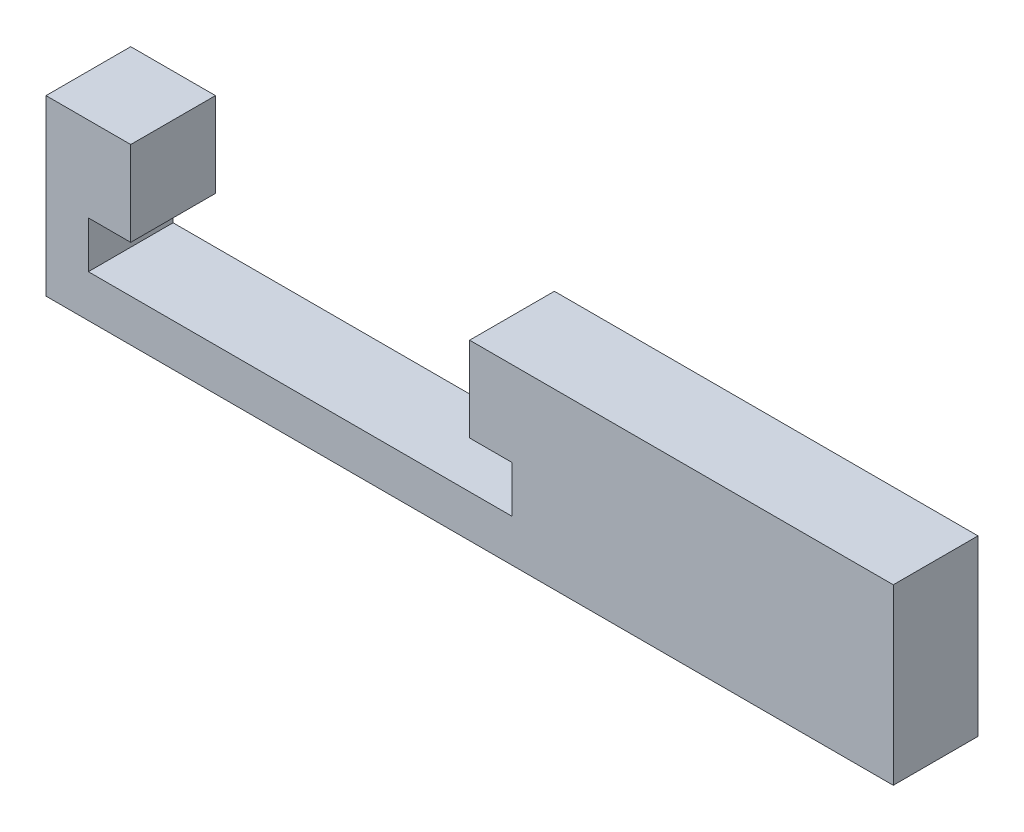
ISO-10303-21;
HEADER;
FILE_DESCRIPTION(('STEP AP214'),'2;1');
FILE_NAME('part.step','',(''),(''),'','','');
FILE_SCHEMA(('AUTOMOTIVE_DESIGN { 1 0 10303 214 1 1 1 1 }'));
ENDSEC;
DATA;
#1=APPLICATION_CONTEXT('core data for automotive mechanical design processes');
#2=APPLICATION_PROTOCOL_DEFINITION('international standard','automotive_design',2000,#1);
#3=PRODUCT_CONTEXT('',#1,'mechanical');
#4=PRODUCT('Part','Part','',(#3));
#5=PRODUCT_RELATED_PRODUCT_CATEGORY('part','',(#4));
#6=PRODUCT_DEFINITION_FORMATION('','',#4);
#7=PRODUCT_DEFINITION_CONTEXT('part definition',#1,'design');
#8=PRODUCT_DEFINITION('design','',#6,#7);
#9=PRODUCT_DEFINITION_SHAPE('','',#8);
#10=(LENGTH_UNIT() NAMED_UNIT(*) SI_UNIT(.MILLI.,.METRE.));
#11=(NAMED_UNIT(*) PLANE_ANGLE_UNIT() SI_UNIT($,.RADIAN.));
#12=(NAMED_UNIT(*) SI_UNIT($,.STERADIAN.) SOLID_ANGLE_UNIT());
#13=UNCERTAINTY_MEASURE_WITH_UNIT(LENGTH_MEASURE(1.E-05),#10,'distance_accuracy_value','');
#14=(GEOMETRIC_REPRESENTATION_CONTEXT(3) GLOBAL_UNCERTAINTY_ASSIGNED_CONTEXT((#13)) GLOBAL_UNIT_ASSIGNED_CONTEXT((#10,
#11,#12)) REPRESENTATION_CONTEXT('',''));
#15=CARTESIAN_POINT('',(0.,0.,0.));
#16=DIRECTION('',(0.,0.,1.));
#17=DIRECTION('',(1.,0.,0.));
#18=AXIS2_PLACEMENT_3D('',#15,#16,#17);
#19=CARTESIAN_POINT('',(-12.7,0.,5.08));
#20=DIRECTION('',(0.,1.,0.));
#21=DIRECTION('',(0.,0.,1.));
#22=AXIS2_PLACEMENT_3D('',#19,#20,#21);
#23=PLANE('',#22);
#24=DIRECTION('',(1.,0.,0.));
#25=VECTOR('',#24,1.);
#26=CARTESIAN_POINT('',(-12.7,0.,0.));
#27=LINE('',#26,#25);
#28=CARTESIAN_POINT('',(-12.7,0.,0.));
#29=VERTEX_POINT('',#28);
#30=CARTESIAN_POINT('',(12.7,0.,0.));
#31=VERTEX_POINT('',#30);
#32=EDGE_CURVE('E155',#29,#31,#27,.T.);
#33=ORIENTED_EDGE('',*,*,#32,.F.);
#34=DIRECTION('',(0.,0.,-1.));
#35=VECTOR('',#34,1.);
#36=CARTESIAN_POINT('',(-12.7,0.,5.08));
#37=LINE('',#36,#35);
#38=CARTESIAN_POINT('',(-12.7,0.,5.08));
#39=VERTEX_POINT('',#38);
#40=EDGE_CURVE('E11',#39,#29,#37,.T.);
#41=ORIENTED_EDGE('',*,*,#40,.F.);
#42=DIRECTION('',(1.,0.,0.));
#43=VECTOR('',#42,1.);
#44=CARTESIAN_POINT('',(-12.7,0.,5.08));
#45=LINE('',#44,#43);
#46=CARTESIAN_POINT('',(12.7,0.,5.08));
#47=VERTEX_POINT('',#46);
#48=EDGE_CURVE('E182',#39,#47,#45,.T.);
#49=ORIENTED_EDGE('',*,*,#48,.T.);
#50=DIRECTION('',(0.,0.,-1.));
#51=VECTOR('',#50,1.);
#52=CARTESIAN_POINT('',(12.7,0.,5.08));
#53=LINE('',#52,#51);
#54=EDGE_CURVE('E36',#47,#31,#53,.T.);
#55=ORIENTED_EDGE('',*,*,#54,.T.);
#56=EDGE_LOOP('',(#33,#41,#49,#55));
#57=FACE_BOUND('',#56,.T.);
#58=ADVANCED_FACE('F33',(#57),#23,.T.);
#59=CARTESIAN_POINT('',(-12.7,0.,5.08));
#60=DIRECTION('',(-1.,0.,0.));
#61=DIRECTION('',(0.,0.,1.));
#62=AXIS2_PLACEMENT_3D('',#59,#60,#61);
#63=PLANE('',#62);
#64=DIRECTION('',(0.,1.,0.));
#65=VECTOR('',#64,1.);
#66=CARTESIAN_POINT('',(-12.7,0.,0.));
#67=LINE('',#66,#65);
#68=CARTESIAN_POINT('',(-12.7,2.794,0.));
#69=VERTEX_POINT('',#68);
#70=EDGE_CURVE('E90',#29,#69,#67,.T.);
#71=ORIENTED_EDGE('',*,*,#70,.T.);
#72=DIRECTION('',(0.,0.,-1.));
#73=VECTOR('',#72,1.);
#74=CARTESIAN_POINT('',(-12.7,2.794,5.08));
#75=LINE('',#74,#73);
#76=CARTESIAN_POINT('',(-12.7,2.794,5.08));
#77=VERTEX_POINT('',#76);
#78=EDGE_CURVE('E42',#77,#69,#75,.T.);
#79=ORIENTED_EDGE('',*,*,#78,.F.);
#80=DIRECTION('',(0.,1.,0.));
#81=VECTOR('',#80,1.);
#82=CARTESIAN_POINT('',(-12.7,0.,5.08));
#83=LINE('',#82,#81);
#84=EDGE_CURVE('E133',#39,#77,#83,.T.);
#85=ORIENTED_EDGE('',*,*,#84,.F.);
#86=ORIENTED_EDGE('',*,*,#40,.T.);
#87=EDGE_LOOP('',(#71,#79,#85,#86));
#88=FACE_BOUND('',#87,.T.);
#89=ADVANCED_FACE('F260',(#88),#63,.F.);
#90=CARTESIAN_POINT('',(-12.7,2.794,5.08));
#91=DIRECTION('',(0.,1.,0.));
#92=DIRECTION('',(0.,0.,1.));
#93=AXIS2_PLACEMENT_3D('',#90,#91,#92);
#94=PLANE('',#93);
#95=DIRECTION('',(1.,0.,0.));
#96=VECTOR('',#95,1.);
#97=CARTESIAN_POINT('',(-12.7,2.794,0.));
#98=LINE('',#97,#96);
#99=CARTESIAN_POINT('',(-10.16,2.794,0.));
#100=VERTEX_POINT('',#99);
#101=EDGE_CURVE('E140',#69,#100,#98,.T.);
#102=ORIENTED_EDGE('',*,*,#101,.T.);
#103=DIRECTION('',(0.,0.,-1.));
#104=VECTOR('',#103,1.);
#105=CARTESIAN_POINT('',(-10.16,2.794,5.08));
#106=LINE('',#105,#104);
#107=CARTESIAN_POINT('',(-10.16,2.794,5.08));
#108=VERTEX_POINT('',#107);
#109=EDGE_CURVE('E137',#108,#100,#106,.T.);
#110=ORIENTED_EDGE('',*,*,#109,.F.);
#111=DIRECTION('',(1.,0.,0.));
#112=VECTOR('',#111,1.);
#113=CARTESIAN_POINT('',(-12.7,2.794,5.08));
#114=LINE('',#113,#112);
#115=EDGE_CURVE('E126',#77,#108,#114,.T.);
#116=ORIENTED_EDGE('',*,*,#115,.F.);
#117=ORIENTED_EDGE('',*,*,#78,.T.);
#118=EDGE_LOOP('',(#102,#110,#116,#117));
#119=FACE_BOUND('',#118,.T.);
#120=ADVANCED_FACE('F138',(#119),#94,.F.);
#121=CARTESIAN_POINT('',(-10.16,2.794,5.08));
#122=DIRECTION('',(-1.,0.,0.));
#123=DIRECTION('',(0.,0.,1.));
#124=AXIS2_PLACEMENT_3D('',#121,#122,#123);
#125=PLANE('',#124);
#126=DIRECTION('',(0.,1.,0.));
#127=VECTOR('',#126,1.);
#128=CARTESIAN_POINT('',(-10.16,2.794,0.));
#129=LINE('',#128,#127);
#130=CARTESIAN_POINT('',(-10.16,7.874,0.));
#131=VERTEX_POINT('',#130);
#132=EDGE_CURVE('E179',#100,#131,#129,.T.);
#133=ORIENTED_EDGE('',*,*,#132,.T.);
#134=DIRECTION('',(0.,0.,-1.));
#135=VECTOR('',#134,1.);
#136=CARTESIAN_POINT('',(-10.16,7.874,5.08));
#137=LINE('',#136,#135);
#138=CARTESIAN_POINT('',(-10.16,7.874,5.08));
#139=VERTEX_POINT('',#138);
#140=EDGE_CURVE('E143',#139,#131,#137,.T.);
#141=ORIENTED_EDGE('',*,*,#140,.F.);
#142=DIRECTION('',(0.,1.,0.));
#143=VECTOR('',#142,1.);
#144=CARTESIAN_POINT('',(-10.16,2.794,5.08));
#145=LINE('',#144,#143);
#146=EDGE_CURVE('E131',#108,#139,#145,.T.);
#147=ORIENTED_EDGE('',*,*,#146,.F.);
#148=ORIENTED_EDGE('',*,*,#109,.T.);
#149=EDGE_LOOP('',(#133,#141,#147,#148));
#150=FACE_BOUND('',#149,.T.);
#151=ADVANCED_FACE('F145',(#150),#125,.F.);
#152=CARTESIAN_POINT('',(-10.16,7.874,5.08));
#153=DIRECTION('',(0.,-1.,0.));
#154=DIRECTION('',(1.,0.,0.));
#155=AXIS2_PLACEMENT_3D('',#152,#153,#154);
#156=PLANE('',#155);
#157=DIRECTION('',(-1.,0.,0.));
#158=VECTOR('',#157,1.);
#159=CARTESIAN_POINT('',(-10.16,7.874,0.));
#160=LINE('',#159,#158);
#161=CARTESIAN_POINT('',(-15.24,7.874,0.));
#162=VERTEX_POINT('',#161);
#163=EDGE_CURVE('E177',#131,#162,#160,.T.);
#164=ORIENTED_EDGE('',*,*,#163,.T.);
#165=DIRECTION('',(0.,0.,-1.));
#166=VECTOR('',#165,1.);
#167=CARTESIAN_POINT('',(-15.24,7.874,5.08));
#168=LINE('',#167,#166);
#169=CARTESIAN_POINT('',(-15.24,7.874,5.08));
#170=VERTEX_POINT('',#169);
#171=EDGE_CURVE('E186',#170,#162,#168,.T.);
#172=ORIENTED_EDGE('',*,*,#171,.F.);
#173=DIRECTION('',(-1.,0.,0.));
#174=VECTOR('',#173,1.);
#175=CARTESIAN_POINT('',(-10.16,7.874,5.08));
#176=LINE('',#175,#174);
#177=EDGE_CURVE('E148',#139,#170,#176,.T.);
#178=ORIENTED_EDGE('',*,*,#177,.F.);
#179=ORIENTED_EDGE('',*,*,#140,.T.);
#180=EDGE_LOOP('',(#164,#172,#178,#179));
#181=FACE_BOUND('',#180,.T.);
#182=ADVANCED_FACE('F209',(#181),#156,.F.);
#183=CARTESIAN_POINT('',(-15.24,7.874,5.08));
#184=DIRECTION('',(1.,0.,0.));
#185=DIRECTION('',(0.,1.,0.));
#186=AXIS2_PLACEMENT_3D('',#183,#184,#185);
#187=PLANE('',#186);
#188=DIRECTION('',(0.,-1.,0.));
#189=VECTOR('',#188,1.);
#190=CARTESIAN_POINT('',(-15.24,7.874,0.));
#191=LINE('',#190,#189);
#192=CARTESIAN_POINT('',(-15.24,-2.54,0.));
#193=VERTEX_POINT('',#192);
#194=EDGE_CURVE('E175',#162,#193,#191,.T.);
#195=ORIENTED_EDGE('',*,*,#194,.T.);
#196=DIRECTION('',(0.,0.,-1.));
#197=VECTOR('',#196,1.);
#198=CARTESIAN_POINT('',(-15.24,-2.54,5.08));
#199=LINE('',#198,#197);
#200=CARTESIAN_POINT('',(-15.24,-2.54,5.08));
#201=VERTEX_POINT('',#200);
#202=EDGE_CURVE('E189',#201,#193,#199,.T.);
#203=ORIENTED_EDGE('',*,*,#202,.F.);
#204=DIRECTION('',(0.,-1.,0.));
#205=VECTOR('',#204,1.);
#206=CARTESIAN_POINT('',(-15.24,7.874,5.08));
#207=LINE('',#206,#205);
#208=EDGE_CURVE('E150',#170,#201,#207,.T.);
#209=ORIENTED_EDGE('',*,*,#208,.F.);
#210=ORIENTED_EDGE('',*,*,#171,.T.);
#211=EDGE_LOOP('',(#195,#203,#209,#210));
#212=FACE_BOUND('',#211,.T.);
#213=ADVANCED_FACE('F219',(#212),#187,.F.);
#214=CARTESIAN_POINT('',(-15.24,-2.54,5.08));
#215=DIRECTION('',(0.,1.,0.));
#216=DIRECTION('',(-1.,0.,0.));
#217=AXIS2_PLACEMENT_3D('',#214,#215,#216);
#218=PLANE('',#217);
#219=DIRECTION('',(1.,0.,0.));
#220=VECTOR('',#219,1.);
#221=CARTESIAN_POINT('',(-15.24,-2.54,0.));
#222=LINE('',#221,#220);
#223=CARTESIAN_POINT('',(35.56,-2.54,0.));
#224=VERTEX_POINT('',#223);
#225=EDGE_CURVE('E173',#193,#224,#222,.T.);
#226=ORIENTED_EDGE('',*,*,#225,.T.);
#227=DIRECTION('',(0.,0.,-1.));
#228=VECTOR('',#227,1.);
#229=CARTESIAN_POINT('',(35.56,-2.54,5.08));
#230=LINE('',#229,#228);
#231=CARTESIAN_POINT('',(35.56,-2.54,5.08));
#232=VERTEX_POINT('',#231);
#233=EDGE_CURVE('E192',#232,#224,#230,.T.);
#234=ORIENTED_EDGE('',*,*,#233,.F.);
#235=DIRECTION('',(-1.,0.,0.));
#236=VECTOR('',#235,1.);
#237=CARTESIAN_POINT('',(35.56,-2.54,5.08));
#238=LINE('',#237,#236);
#239=EDGE_CURVE('E216',#232,#201,#238,.T.);
#240=ORIENTED_EDGE('',*,*,#239,.T.);
#241=ORIENTED_EDGE('',*,*,#202,.T.);
#242=EDGE_LOOP('',(#226,#234,#240,#241));
#243=FACE_BOUND('',#242,.T.);
#244=ADVANCED_FACE('F222',(#243),#218,.F.);
#245=CARTESIAN_POINT('',(35.56,7.87400000000001,5.08));
#246=DIRECTION('',(1.,0.,0.));
#247=DIRECTION('',(0.,0.,-1.));
#248=AXIS2_PLACEMENT_3D('',#245,#246,#247);
#249=PLANE('',#248);
#250=DIRECTION('',(0.,-1.,0.));
#251=VECTOR('',#250,1.);
#252=CARTESIAN_POINT('',(35.56,7.87400000000001,0.));
#253=LINE('',#252,#251);
#254=CARTESIAN_POINT('',(35.56,7.87400000000001,0.));
#255=VERTEX_POINT('',#254);
#256=EDGE_CURVE('E170',#255,#224,#253,.T.);
#257=ORIENTED_EDGE('',*,*,#256,.F.);
#258=DIRECTION('',(0.,0.,-1.));
#259=VECTOR('',#258,1.);
#260=CARTESIAN_POINT('',(35.56,7.87400000000001,5.08));
#261=LINE('',#260,#259);
#262=CARTESIAN_POINT('',(35.56,7.87400000000001,5.08));
#263=VERTEX_POINT('',#262);
#264=EDGE_CURVE('E195',#263,#255,#261,.T.);
#265=ORIENTED_EDGE('',*,*,#264,.F.);
#266=DIRECTION('',(0.,-1.,0.));
#267=VECTOR('',#266,1.);
#268=CARTESIAN_POINT('',(35.56,7.87400000000001,5.08));
#269=LINE('',#268,#267);
#270=EDGE_CURVE('E227',#263,#232,#269,.T.);
#271=ORIENTED_EDGE('',*,*,#270,.T.);
#272=ORIENTED_EDGE('',*,*,#233,.T.);
#273=EDGE_LOOP('',(#257,#265,#271,#272));
#274=FACE_BOUND('',#273,.T.);
#275=ADVANCED_FACE('F226',(#274),#249,.T.);
#276=CARTESIAN_POINT('',(15.24,7.87400000000001,5.08));
#277=DIRECTION('',(0.,1.,0.));
#278=DIRECTION('',(0.,0.,1.));
#279=AXIS2_PLACEMENT_3D('',#276,#277,#278);
#280=PLANE('',#279);
#281=DIRECTION('',(1.,0.,0.));
#282=VECTOR('',#281,1.);
#283=CARTESIAN_POINT('',(15.24,7.87400000000001,0.));
#284=LINE('',#283,#282);
#285=CARTESIAN_POINT('',(10.16,7.874,0.));
#286=VERTEX_POINT('',#285);
#287=EDGE_CURVE('E167',#286,#255,#284,.T.);
#288=ORIENTED_EDGE('',*,*,#287,.F.);
#289=DIRECTION('',(0.,0.,-1.));
#290=VECTOR('',#289,1.);
#291=CARTESIAN_POINT('',(10.16,7.874,5.08));
#292=LINE('',#291,#290);
#293=CARTESIAN_POINT('',(10.16,7.874,5.08));
#294=VERTEX_POINT('',#293);
#295=EDGE_CURVE('E197',#294,#286,#292,.T.);
#296=ORIENTED_EDGE('',*,*,#295,.F.);
#297=DIRECTION('',(1.,0.,0.));
#298=VECTOR('',#297,1.);
#299=CARTESIAN_POINT('',(10.16,7.874,5.08));
#300=LINE('',#299,#298);
#301=EDGE_CURVE('E229',#294,#263,#300,.T.);
#302=ORIENTED_EDGE('',*,*,#301,.T.);
#303=ORIENTED_EDGE('',*,*,#264,.T.);
#304=EDGE_LOOP('',(#288,#296,#302,#303));
#305=FACE_BOUND('',#304,.T.);
#306=ADVANCED_FACE('F250',(#305),#280,.T.);
#307=CARTESIAN_POINT('',(10.16,2.794,5.08));
#308=DIRECTION('',(-1.,0.,0.));
#309=DIRECTION('',(0.,-1.,0.));
#310=AXIS2_PLACEMENT_3D('',#307,#308,#309);
#311=PLANE('',#310);
#312=DIRECTION('',(0.,1.,0.));
#313=VECTOR('',#312,1.);
#314=CARTESIAN_POINT('',(10.16,2.794,0.));
#315=LINE('',#314,#313);
#316=CARTESIAN_POINT('',(10.16,2.794,0.));
#317=VERTEX_POINT('',#316);
#318=EDGE_CURVE('E164',#317,#286,#315,.T.);
#319=ORIENTED_EDGE('',*,*,#318,.F.);
#320=DIRECTION('',(0.,0.,-1.));
#321=VECTOR('',#320,1.);
#322=CARTESIAN_POINT('',(10.16,2.794,5.08));
#323=LINE('',#322,#321);
#324=CARTESIAN_POINT('',(10.16,2.794,5.08));
#325=VERTEX_POINT('',#324);
#326=EDGE_CURVE('E200',#325,#317,#323,.T.);
#327=ORIENTED_EDGE('',*,*,#326,.F.);
#328=DIRECTION('',(0.,1.,0.));
#329=VECTOR('',#328,1.);
#330=CARTESIAN_POINT('',(10.16,2.794,5.08));
#331=LINE('',#330,#329);
#332=EDGE_CURVE('E232',#325,#294,#331,.T.);
#333=ORIENTED_EDGE('',*,*,#332,.T.);
#334=ORIENTED_EDGE('',*,*,#295,.T.);
#335=EDGE_LOOP('',(#319,#327,#333,#334));
#336=FACE_BOUND('',#335,.T.);
#337=ADVANCED_FACE('F248',(#336),#311,.T.);
#338=CARTESIAN_POINT('',(12.7,2.794,5.08));
#339=DIRECTION('',(0.,-1.,0.));
#340=DIRECTION('',(1.,0.,0.));
#341=AXIS2_PLACEMENT_3D('',#338,#339,#340);
#342=PLANE('',#341);
#343=DIRECTION('',(-1.,0.,0.));
#344=VECTOR('',#343,1.);
#345=CARTESIAN_POINT('',(12.7,2.794,0.));
#346=LINE('',#345,#344);
#347=CARTESIAN_POINT('',(12.7,2.794,0.));
#348=VERTEX_POINT('',#347);
#349=EDGE_CURVE('E161',#348,#317,#346,.T.);
#350=ORIENTED_EDGE('',*,*,#349,.F.);
#351=DIRECTION('',(0.,0.,-1.));
#352=VECTOR('',#351,1.);
#353=CARTESIAN_POINT('',(12.7,2.794,5.08));
#354=LINE('',#353,#352);
#355=CARTESIAN_POINT('',(12.7,2.794,5.08));
#356=VERTEX_POINT('',#355);
#357=EDGE_CURVE('E201',#356,#348,#354,.T.);
#358=ORIENTED_EDGE('',*,*,#357,.F.);
#359=DIRECTION('',(-1.,0.,0.));
#360=VECTOR('',#359,1.);
#361=CARTESIAN_POINT('',(12.7,2.794,5.08));
#362=LINE('',#361,#360);
#363=EDGE_CURVE('E237',#356,#325,#362,.T.);
#364=ORIENTED_EDGE('',*,*,#363,.T.);
#365=ORIENTED_EDGE('',*,*,#326,.T.);
#366=EDGE_LOOP('',(#350,#358,#364,#365));
#367=FACE_BOUND('',#366,.T.);
#368=ADVANCED_FACE('F245',(#367),#342,.T.);
#369=CARTESIAN_POINT('',(12.7,0.,5.08));
#370=DIRECTION('',(-1.,0.,0.));
#371=DIRECTION('',(0.,0.,1.));
#372=AXIS2_PLACEMENT_3D('',#369,#370,#371);
#373=PLANE('',#372);
#374=DIRECTION('',(0.,1.,0.));
#375=VECTOR('',#374,1.);
#376=CARTESIAN_POINT('',(12.7,0.,0.));
#377=LINE('',#376,#375);
#378=EDGE_CURVE('E158',#31,#348,#377,.T.);
#379=ORIENTED_EDGE('',*,*,#378,.F.);
#380=ORIENTED_EDGE('',*,*,#54,.F.);
#381=DIRECTION('',(0.,1.,0.));
#382=VECTOR('',#381,1.);
#383=CARTESIAN_POINT('',(12.7,0.,5.08));
#384=LINE('',#383,#382);
#385=EDGE_CURVE('E240',#47,#356,#384,.T.);
#386=ORIENTED_EDGE('',*,*,#385,.T.);
#387=ORIENTED_EDGE('',*,*,#357,.T.);
#388=EDGE_LOOP('',(#379,#380,#386,#387));
#389=FACE_BOUND('',#388,.T.);
#390=ADVANCED_FACE('F203',(#389),#373,.T.);
#391=CARTESIAN_POINT('',(0.,0.,5.08));
#392=DIRECTION('',(0.,0.,1.));
#393=DIRECTION('',(1.,0.,0.));
#394=AXIS2_PLACEMENT_3D('',#391,#392,#393);
#395=PLANE('',#394);
#396=ORIENTED_EDGE('',*,*,#48,.F.);
#397=ORIENTED_EDGE('',*,*,#84,.T.);
#398=ORIENTED_EDGE('',*,*,#115,.T.);
#399=ORIENTED_EDGE('',*,*,#146,.T.);
#400=ORIENTED_EDGE('',*,*,#177,.T.);
#401=ORIENTED_EDGE('',*,*,#208,.T.);
#402=ORIENTED_EDGE('',*,*,#239,.F.);
#403=ORIENTED_EDGE('',*,*,#270,.F.);
#404=ORIENTED_EDGE('',*,*,#301,.F.);
#405=ORIENTED_EDGE('',*,*,#332,.F.);
#406=ORIENTED_EDGE('',*,*,#363,.F.);
#407=ORIENTED_EDGE('',*,*,#385,.F.);
#408=EDGE_LOOP('',(#396,#397,#398,#399,#400,#401,#402,#403,#404,#405,#406,#407));
#409=FACE_BOUND('',#408,.T.);
#410=ADVANCED_FACE('F129',(#409),#395,.T.);
#411=CARTESIAN_POINT('',(0.,0.,0.));
#412=DIRECTION('',(0.,0.,1.));
#413=DIRECTION('',(1.,0.,0.));
#414=AXIS2_PLACEMENT_3D('',#411,#412,#413);
#415=PLANE('',#414);
#416=ORIENTED_EDGE('',*,*,#32,.T.);
#417=ORIENTED_EDGE('',*,*,#378,.T.);
#418=ORIENTED_EDGE('',*,*,#349,.T.);
#419=ORIENTED_EDGE('',*,*,#318,.T.);
#420=ORIENTED_EDGE('',*,*,#287,.T.);
#421=ORIENTED_EDGE('',*,*,#256,.T.);
#422=ORIENTED_EDGE('',*,*,#225,.F.);
#423=ORIENTED_EDGE('',*,*,#194,.F.);
#424=ORIENTED_EDGE('',*,*,#163,.F.);
#425=ORIENTED_EDGE('',*,*,#132,.F.);
#426=ORIENTED_EDGE('',*,*,#101,.F.);
#427=ORIENTED_EDGE('',*,*,#70,.F.);
#428=EDGE_LOOP('',(#416,#417,#418,#419,#420,#421,#422,#423,#424,#425,#426,#427));
#429=FACE_BOUND('',#428,.T.);
#430=ADVANCED_FACE('F205',(#429),#415,.F.);
#431=CLOSED_SHELL('',(#58,#89,#120,#151,#182,#213,#244,#275,#306,#337,#368,#390,#410,#430));
#432=MANIFOLD_SOLID_BREP('B2',#431);
#433=ADVANCED_BREP_SHAPE_REPRESENTATION('',(#18,#432),#14);
#434=SHAPE_DEFINITION_REPRESENTATION(#9,#433);
ENDSEC;
END-ISO-10303-21;
